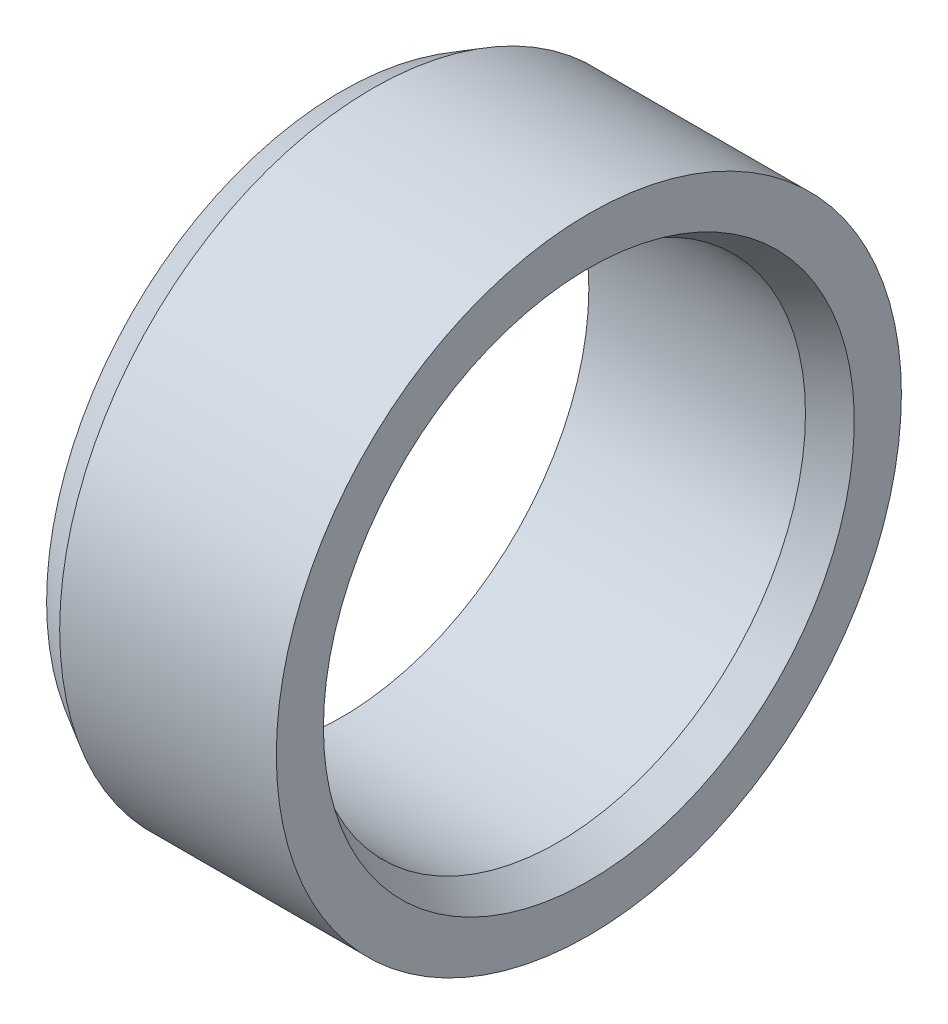
ISO-10303-21;
HEADER;
FILE_DESCRIPTION(('STEP AP214'),'2;1');
FILE_NAME('part.step','',(''),(''),'','','');
FILE_SCHEMA(('AUTOMOTIVE_DESIGN { 1 0 10303 214 1 1 1 1 }'));
ENDSEC;
DATA;
#1=APPLICATION_CONTEXT('core data for automotive mechanical design processes');
#2=APPLICATION_PROTOCOL_DEFINITION('international standard','automotive_design',2000,#1);
#3=PRODUCT_CONTEXT('',#1,'mechanical');
#4=PRODUCT('Part','Part','',(#3));
#5=PRODUCT_RELATED_PRODUCT_CATEGORY('part','',(#4));
#6=PRODUCT_DEFINITION_FORMATION('','',#4);
#7=PRODUCT_DEFINITION_CONTEXT('part definition',#1,'design');
#8=PRODUCT_DEFINITION('design','',#6,#7);
#9=PRODUCT_DEFINITION_SHAPE('','',#8);
#10=(LENGTH_UNIT() NAMED_UNIT(*) SI_UNIT(.MILLI.,.METRE.));
#11=(NAMED_UNIT(*) PLANE_ANGLE_UNIT() SI_UNIT($,.RADIAN.));
#12=(NAMED_UNIT(*) SI_UNIT($,.STERADIAN.) SOLID_ANGLE_UNIT());
#13=UNCERTAINTY_MEASURE_WITH_UNIT(LENGTH_MEASURE(1.E-05),#10,'distance_accuracy_value','');
#14=(GEOMETRIC_REPRESENTATION_CONTEXT(3) GLOBAL_UNCERTAINTY_ASSIGNED_CONTEXT((#13)) GLOBAL_UNIT_ASSIGNED_CONTEXT((#10,
#11,#12)) REPRESENTATION_CONTEXT('',''));
#15=CARTESIAN_POINT('',(0.,0.,0.));
#16=DIRECTION('',(0.,0.,1.));
#17=DIRECTION('',(1.,0.,0.));
#18=AXIS2_PLACEMENT_3D('',#15,#16,#17);
#19=CARTESIAN_POINT('',(-1.5,0.,0.));
#20=DIRECTION('',(1.,0.,0.));
#21=DIRECTION('',(0.,0.,-1.));
#22=AXIS2_PLACEMENT_3D('',#19,#20,#21);
#23=CONICAL_SURFACE('',#22,5.05,0.523598775598301);
#24=CARTESIAN_POINT('',(-2.,0.,0.));
#25=DIRECTION('',(-1.,0.,0.));
#26=DIRECTION('',(0.,0.,1.));
#27=AXIS2_PLACEMENT_3D('',#24,#25,#26);
#28=CIRCLE('',#27,4.76132486540519);
#29=CARTESIAN_POINT('',(-2.,0.,4.76132486540519));
#30=VERTEX_POINT('',#29);
#31=EDGE_CURVE('E52',#30,#30,#28,.T.);
#32=ORIENTED_EDGE('',*,*,#31,.F.);
#33=EDGE_LOOP('',(#32));
#34=FACE_BOUND('',#33,.T.);
#35=CARTESIAN_POINT('',(-1.5,0.,0.));
#36=DIRECTION('',(-1.,0.,0.));
#37=DIRECTION('',(0.,0.,1.));
#38=AXIS2_PLACEMENT_3D('',#35,#36,#37);
#39=CIRCLE('',#38,5.05);
#40=CARTESIAN_POINT('',(-1.5,0.,5.05));
#41=VERTEX_POINT('',#40);
#42=EDGE_CURVE('E10',#41,#41,#39,.T.);
#43=ORIENTED_EDGE('',*,*,#42,.T.);
#44=EDGE_LOOP('',(#43));
#45=FACE_BOUND('',#44,.T.);
#46=ADVANCED_FACE('F30',(#34,#45),#23,.T.);
#47=CARTESIAN_POINT('',(-2.,0.,0.));
#48=DIRECTION('',(-1.,0.,0.));
#49=DIRECTION('',(0.,0.,1.));
#50=AXIS2_PLACEMENT_3D('',#47,#48,#49);
#51=CYLINDRICAL_SURFACE('',#50,5.05);
#52=ORIENTED_EDGE('',*,*,#42,.F.);
#53=EDGE_LOOP('',(#52));
#54=FACE_BOUND('',#53,.T.);
#55=CARTESIAN_POINT('',(2.,0.,0.));
#56=DIRECTION('',(-1.,0.,0.));
#57=DIRECTION('',(0.,0.,1.));
#58=AXIS2_PLACEMENT_3D('',#55,#56,#57);
#59=CIRCLE('',#58,5.05);
#60=CARTESIAN_POINT('',(2.,0.,5.05));
#61=VERTEX_POINT('',#60);
#62=EDGE_CURVE('E36',#61,#61,#59,.T.);
#63=ORIENTED_EDGE('',*,*,#62,.T.);
#64=EDGE_LOOP('',(#63));
#65=FACE_BOUND('',#64,.T.);
#66=ADVANCED_FACE('F59',(#54,#65),#51,.T.);
#67=CARTESIAN_POINT('',(2.,0.,-5.05));
#68=DIRECTION('',(-1.,0.,0.));
#69=DIRECTION('',(0.,0.,1.));
#70=AXIS2_PLACEMENT_3D('',#67,#68,#69);
#71=PLANE('',#70);
#72=ORIENTED_EDGE('',*,*,#62,.F.);
#73=EDGE_LOOP('',(#72));
#74=FACE_BOUND('',#73,.T.);
#75=CARTESIAN_POINT('',(2.,0.,0.));
#76=DIRECTION('',(-1.,0.,0.));
#77=DIRECTION('',(0.,0.,1.));
#78=AXIS2_PLACEMENT_3D('',#75,#76,#77);
#79=CIRCLE('',#78,4.28867513459481);
#80=CARTESIAN_POINT('',(2.,0.,4.28867513459481));
#81=VERTEX_POINT('',#80);
#82=EDGE_CURVE('E40',#81,#81,#79,.T.);
#83=ORIENTED_EDGE('',*,*,#82,.T.);
#84=EDGE_LOOP('',(#83));
#85=FACE_BOUND('',#84,.T.);
#86=ADVANCED_FACE('F63',(#74,#85),#71,.F.);
#87=CARTESIAN_POINT('',(1.5,0.,0.));
#88=DIRECTION('',(1.,0.,0.));
#89=DIRECTION('',(0.,0.,-1.));
#90=AXIS2_PLACEMENT_3D('',#87,#88,#89);
#91=CONICAL_SURFACE('',#90,4.,0.523598775598301);
#92=ORIENTED_EDGE('',*,*,#82,.F.);
#93=EDGE_LOOP('',(#92));
#94=FACE_BOUND('',#93,.T.);
#95=CARTESIAN_POINT('',(1.5,0.,0.));
#96=DIRECTION('',(-1.,0.,0.));
#97=DIRECTION('',(0.,0.,1.));
#98=AXIS2_PLACEMENT_3D('',#95,#96,#97);
#99=CIRCLE('',#98,4.);
#100=CARTESIAN_POINT('',(1.5,0.,4.));
#101=VERTEX_POINT('',#100);
#102=EDGE_CURVE('E44',#101,#101,#99,.T.);
#103=ORIENTED_EDGE('',*,*,#102,.T.);
#104=EDGE_LOOP('',(#103));
#105=FACE_BOUND('',#104,.T.);
#106=ADVANCED_FACE('F68',(#94,#105),#91,.F.);
#107=CARTESIAN_POINT('',(-2.,0.,0.));
#108=DIRECTION('',(-1.,0.,0.));
#109=DIRECTION('',(0.,0.,1.));
#110=AXIS2_PLACEMENT_3D('',#107,#108,#109);
#111=CYLINDRICAL_SURFACE('',#110,4.);
#112=ORIENTED_EDGE('',*,*,#102,.F.);
#113=EDGE_LOOP('',(#112));
#114=FACE_BOUND('',#113,.T.);
#115=CARTESIAN_POINT('',(-2.,0.,0.));
#116=DIRECTION('',(-1.,0.,0.));
#117=DIRECTION('',(0.,0.,1.));
#118=AXIS2_PLACEMENT_3D('',#115,#116,#117);
#119=CIRCLE('',#118,4.);
#120=CARTESIAN_POINT('',(-2.,0.,4.));
#121=VERTEX_POINT('',#120);
#122=EDGE_CURVE('E49',#121,#121,#119,.T.);
#123=ORIENTED_EDGE('',*,*,#122,.T.);
#124=EDGE_LOOP('',(#123));
#125=FACE_BOUND('',#124,.T.);
#126=ADVANCED_FACE('F74',(#114,#125),#111,.F.);
#127=CARTESIAN_POINT('',(-2.,0.,-4.));
#128=DIRECTION('',(1.,0.,0.));
#129=DIRECTION('',(0.,0.,-1.));
#130=AXIS2_PLACEMENT_3D('',#127,#128,#129);
#131=PLANE('',#130);
#132=ORIENTED_EDGE('',*,*,#122,.F.);
#133=EDGE_LOOP('',(#132));
#134=FACE_BOUND('',#133,.T.);
#135=ORIENTED_EDGE('',*,*,#31,.T.);
#136=EDGE_LOOP('',(#135));
#137=FACE_BOUND('',#136,.T.);
#138=ADVANCED_FACE('F56',(#134,#137),#131,.F.);
#139=CLOSED_SHELL('',(#46,#66,#86,#106,#126,#138));
#140=MANIFOLD_SOLID_BREP('B2',#139);
#141=ADVANCED_BREP_SHAPE_REPRESENTATION('',(#18,#140),#14);
#142=SHAPE_DEFINITION_REPRESENTATION(#9,#141);
ENDSEC;
END-ISO-10303-21;
